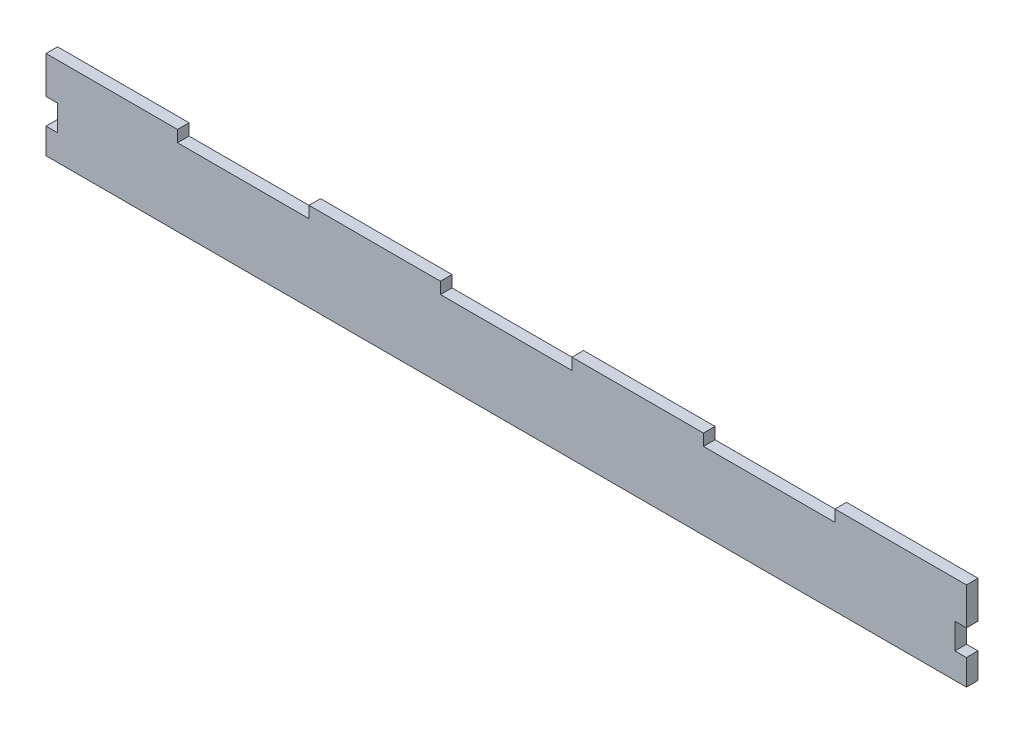
ISO-10303-21;
HEADER;
FILE_DESCRIPTION(('STEP AP214'),'2;1');
FILE_NAME('part.step','',(''),(''),'','','');
FILE_SCHEMA(('AUTOMOTIVE_DESIGN { 1 0 10303 214 1 1 1 1 }'));
ENDSEC;
DATA;
#1=APPLICATION_CONTEXT('core data for automotive mechanical design processes');
#2=APPLICATION_PROTOCOL_DEFINITION('international standard','automotive_design',2000,#1);
#3=PRODUCT_CONTEXT('',#1,'mechanical');
#4=PRODUCT('Part','Part','',(#3));
#5=PRODUCT_RELATED_PRODUCT_CATEGORY('part','',(#4));
#6=PRODUCT_DEFINITION_FORMATION('','',#4);
#7=PRODUCT_DEFINITION_CONTEXT('part definition',#1,'design');
#8=PRODUCT_DEFINITION('design','',#6,#7);
#9=PRODUCT_DEFINITION_SHAPE('','',#8);
#10=(LENGTH_UNIT() NAMED_UNIT(*) SI_UNIT(.MILLI.,.METRE.));
#11=(NAMED_UNIT(*) PLANE_ANGLE_UNIT() SI_UNIT($,.RADIAN.));
#12=(NAMED_UNIT(*) SI_UNIT($,.STERADIAN.) SOLID_ANGLE_UNIT());
#13=UNCERTAINTY_MEASURE_WITH_UNIT(LENGTH_MEASURE(1.E-05),#10,'distance_accuracy_value','');
#14=(GEOMETRIC_REPRESENTATION_CONTEXT(3) GLOBAL_UNCERTAINTY_ASSIGNED_CONTEXT((#13)) GLOBAL_UNIT_ASSIGNED_CONTEXT((#10,
#11,#12)) REPRESENTATION_CONTEXT('',''));
#15=CARTESIAN_POINT('',(0.,0.,0.));
#16=DIRECTION('',(0.,0.,1.));
#17=DIRECTION('',(1.,0.,0.));
#18=AXIS2_PLACEMENT_3D('',#15,#16,#17);
#19=CARTESIAN_POINT('',(0.,-34.,-69.25));
#20=DIRECTION('',(0.,0.,-1.));
#21=DIRECTION('',(-1.,0.,0.));
#22=AXIS2_PLACEMENT_3D('',#19,#20,#21);
#23=PLANE('',#22);
#24=DIRECTION('',(0.,1.,0.));
#25=VECTOR('',#24,1.);
#26=CARTESIAN_POINT('',(239.,-34.,-69.25));
#27=LINE('',#26,#25);
#28=CARTESIAN_POINT('',(239.,-7.33333333333333,-69.25));
#29=VERTEX_POINT('',#28);
#30=CARTESIAN_POINT('',(239.,12.,-69.25));
#31=VERTEX_POINT('',#30);
#32=EDGE_CURVE('E48',#29,#31,#27,.T.);
#33=ORIENTED_EDGE('',*,*,#32,.F.);
#34=DIRECTION('',(1.,0.,0.));
#35=VECTOR('',#34,1.);
#36=CARTESIAN_POINT('',(0.,-7.3333333333334,-69.25));
#37=LINE('',#36,#35);
#38=CARTESIAN_POINT('',(233.,-7.33333333333333,-69.25));
#39=VERTEX_POINT('',#38);
#40=EDGE_CURVE('E211',#39,#29,#37,.T.);
#41=ORIENTED_EDGE('',*,*,#40,.F.);
#42=DIRECTION('',(0.,1.,0.));
#43=VECTOR('',#42,1.);
#44=CARTESIAN_POINT('',(233.,0.,-69.25));
#45=LINE('',#44,#43);
#46=CARTESIAN_POINT('',(233.,-20.6666666666667,-69.25));
#47=VERTEX_POINT('',#46);
#48=EDGE_CURVE('E212',#47,#39,#45,.T.);
#49=ORIENTED_EDGE('',*,*,#48,.F.);
#50=DIRECTION('',(-1.,0.,0.));
#51=VECTOR('',#50,1.);
#52=CARTESIAN_POINT('',(0.,-20.6666666666667,-69.25));
#53=LINE('',#52,#51);
#54=CARTESIAN_POINT('',(239.,-20.6666666666667,-69.25));
#55=VERTEX_POINT('',#54);
#56=EDGE_CURVE('E203',#55,#47,#53,.T.);
#57=ORIENTED_EDGE('',*,*,#56,.F.);
#58=CARTESIAN_POINT('',(239.,-34.,-69.25));
#59=VERTEX_POINT('',#58);
#60=EDGE_CURVE('E11',#59,#55,#27,.T.);
#61=ORIENTED_EDGE('',*,*,#60,.F.);
#62=DIRECTION('',(-1.,0.,0.));
#63=VECTOR('',#62,1.);
#64=CARTESIAN_POINT('',(0.,-34.,-69.25));
#65=LINE('',#64,#63);
#66=CARTESIAN_POINT('',(-239.,-34.,-69.2499999999999));
#67=VERTEX_POINT('',#66);
#68=EDGE_CURVE('E351',#59,#67,#65,.T.);
#69=ORIENTED_EDGE('',*,*,#68,.T.);
#70=DIRECTION('',(0.,1.,0.));
#71=VECTOR('',#70,1.);
#72=CARTESIAN_POINT('',(-239.,-34.,-69.2499999999999));
#73=LINE('',#72,#71);
#74=CARTESIAN_POINT('',(-239.,-20.6666666666667,-69.25));
#75=VERTEX_POINT('',#74);
#76=EDGE_CURVE('E43',#67,#75,#73,.T.);
#77=ORIENTED_EDGE('',*,*,#76,.T.);
#78=DIRECTION('',(1.,0.,0.));
#79=VECTOR('',#78,1.);
#80=CARTESIAN_POINT('',(0.,-20.6666666666667,-69.25));
#81=LINE('',#80,#79);
#82=CARTESIAN_POINT('',(-233.,-20.6666666666667,-69.25));
#83=VERTEX_POINT('',#82);
#84=EDGE_CURVE('E241',#75,#83,#81,.T.);
#85=ORIENTED_EDGE('',*,*,#84,.T.);
#86=DIRECTION('',(0.,1.,0.));
#87=VECTOR('',#86,1.);
#88=CARTESIAN_POINT('',(-233.,0.,-69.25));
#89=LINE('',#88,#87);
#90=CARTESIAN_POINT('',(-233.,-7.33333333333333,-69.25));
#91=VERTEX_POINT('',#90);
#92=EDGE_CURVE('E234',#83,#91,#89,.T.);
#93=ORIENTED_EDGE('',*,*,#92,.T.);
#94=DIRECTION('',(-1.,0.,0.));
#95=VECTOR('',#94,1.);
#96=CARTESIAN_POINT('',(0.,-7.3333333333334,-69.25));
#97=LINE('',#96,#95);
#98=CARTESIAN_POINT('',(-239.,-7.33333333333333,-69.25));
#99=VERTEX_POINT('',#98);
#100=EDGE_CURVE('E237',#91,#99,#97,.T.);
#101=ORIENTED_EDGE('',*,*,#100,.T.);
#102=CARTESIAN_POINT('',(-239.,12.,-69.2499999999999));
#103=VERTEX_POINT('',#102);
#104=EDGE_CURVE('E363',#99,#103,#73,.T.);
#105=ORIENTED_EDGE('',*,*,#104,.T.);
#106=DIRECTION('',(-1.,0.,0.));
#107=VECTOR('',#106,1.);
#108=CARTESIAN_POINT('',(0.,12.,-69.25));
#109=LINE('',#108,#107);
#110=CARTESIAN_POINT('',(-170.714285714286,12.,-69.2499999999999));
#111=VERTEX_POINT('',#110);
#112=EDGE_CURVE('E330',#111,#103,#109,.T.);
#113=ORIENTED_EDGE('',*,*,#112,.F.);
#114=DIRECTION('',(0.,-1.,0.));
#115=VECTOR('',#114,1.);
#116=CARTESIAN_POINT('',(-170.714285714286,12.,-69.2499999999999));
#117=LINE('',#116,#115);
#118=CARTESIAN_POINT('',(-170.714285714286,6.,-69.2499999999999));
#119=VERTEX_POINT('',#118);
#120=EDGE_CURVE('E342',#111,#119,#117,.T.);
#121=ORIENTED_EDGE('',*,*,#120,.T.);
#122=DIRECTION('',(-1.,0.,0.));
#123=VECTOR('',#122,1.);
#124=CARTESIAN_POINT('',(0.,6.,-69.25));
#125=LINE('',#124,#123);
#126=CARTESIAN_POINT('',(-102.428571428571,6.,-69.25));
#127=VERTEX_POINT('',#126);
#128=EDGE_CURVE('E350',#127,#119,#125,.T.);
#129=ORIENTED_EDGE('',*,*,#128,.F.);
#130=DIRECTION('',(0.,-1.,0.));
#131=VECTOR('',#130,1.);
#132=CARTESIAN_POINT('',(-102.428571428571,12.,-69.25));
#133=LINE('',#132,#131);
#134=CARTESIAN_POINT('',(-102.428571428571,12.,-69.25));
#135=VERTEX_POINT('',#134);
#136=EDGE_CURVE('E327',#135,#127,#133,.T.);
#137=ORIENTED_EDGE('',*,*,#136,.F.);
#138=DIRECTION('',(-1.,0.,0.));
#139=VECTOR('',#138,1.);
#140=CARTESIAN_POINT('',(0.,12.,-69.25));
#141=LINE('',#140,#139);
#142=CARTESIAN_POINT('',(-34.1428571428572,12.,-69.25));
#143=VERTEX_POINT('',#142);
#144=EDGE_CURVE('E303',#143,#135,#141,.T.);
#145=ORIENTED_EDGE('',*,*,#144,.F.);
#146=DIRECTION('',(0.,-1.,0.));
#147=VECTOR('',#146,1.);
#148=CARTESIAN_POINT('',(-34.1428571428572,12.,-69.25));
#149=LINE('',#148,#147);
#150=CARTESIAN_POINT('',(-34.1428571428572,6.,-69.25));
#151=VERTEX_POINT('',#150);
#152=EDGE_CURVE('E315',#143,#151,#149,.T.);
#153=ORIENTED_EDGE('',*,*,#152,.T.);
#154=CARTESIAN_POINT('',(34.1428571428571,6.,-69.25));
#155=VERTEX_POINT('',#154);
#156=EDGE_CURVE('E367',#155,#151,#125,.T.);
#157=ORIENTED_EDGE('',*,*,#156,.F.);
#158=DIRECTION('',(0.,-1.,0.));
#159=VECTOR('',#158,1.);
#160=CARTESIAN_POINT('',(34.1428571428571,12.,-69.25));
#161=LINE('',#160,#159);
#162=CARTESIAN_POINT('',(34.1428571428571,12.,-69.25));
#163=VERTEX_POINT('',#162);
#164=EDGE_CURVE('E300',#163,#155,#161,.T.);
#165=ORIENTED_EDGE('',*,*,#164,.F.);
#166=DIRECTION('',(-1.,0.,0.));
#167=VECTOR('',#166,1.);
#168=CARTESIAN_POINT('',(0.,12.,-69.25));
#169=LINE('',#168,#167);
#170=CARTESIAN_POINT('',(102.428571428571,12.,-69.25));
#171=VERTEX_POINT('',#170);
#172=EDGE_CURVE('E276',#171,#163,#169,.T.);
#173=ORIENTED_EDGE('',*,*,#172,.F.);
#174=DIRECTION('',(0.,-1.,0.));
#175=VECTOR('',#174,1.);
#176=CARTESIAN_POINT('',(102.428571428571,12.,-69.25));
#177=LINE('',#176,#175);
#178=CARTESIAN_POINT('',(102.428571428571,6.,-69.25));
#179=VERTEX_POINT('',#178);
#180=EDGE_CURVE('E288',#171,#179,#177,.T.);
#181=ORIENTED_EDGE('',*,*,#180,.T.);
#182=CARTESIAN_POINT('',(170.714285714286,6.,-69.25));
#183=VERTEX_POINT('',#182);
#184=EDGE_CURVE('E364',#183,#179,#125,.T.);
#185=ORIENTED_EDGE('',*,*,#184,.F.);
#186=DIRECTION('',(0.,-1.,0.));
#187=VECTOR('',#186,1.);
#188=CARTESIAN_POINT('',(170.714285714286,12.,-69.25));
#189=LINE('',#188,#187);
#190=CARTESIAN_POINT('',(170.714285714286,12.,-69.25));
#191=VERTEX_POINT('',#190);
#192=EDGE_CURVE('E273',#191,#183,#189,.T.);
#193=ORIENTED_EDGE('',*,*,#192,.F.);
#194=DIRECTION('',(1.,0.,0.));
#195=VECTOR('',#194,1.);
#196=CARTESIAN_POINT('',(0.,12.,-69.25));
#197=LINE('',#196,#195);
#198=EDGE_CURVE('E258',#191,#31,#197,.T.);
#199=ORIENTED_EDGE('',*,*,#198,.T.);
#200=EDGE_LOOP('',(#33,#41,#49,#57,#61,#69,#77,#85,#93,#101,#105,#113,#121,#129,#137,#145,#153,
#157,#165,#173,#181,#185,#193,#199));
#201=FACE_BOUND('',#200,.T.);
#202=ADVANCED_FACE('F39',(#201),#23,.T.);
#203=CARTESIAN_POINT('',(239.,-34.,0.));
#204=DIRECTION('',(1.,0.,0.));
#205=DIRECTION('',(0.,0.,-1.));
#206=AXIS2_PLACEMENT_3D('',#203,#204,#205);
#207=PLANE('',#206);
#208=DIRECTION('',(0.,1.,0.));
#209=VECTOR('',#208,1.);
#210=CARTESIAN_POINT('',(239.,-34.,-63.25));
#211=LINE('',#210,#209);
#212=CARTESIAN_POINT('',(239.,-7.33333333333333,-63.25));
#213=VERTEX_POINT('',#212);
#214=CARTESIAN_POINT('',(239.,12.,-63.25));
#215=VERTEX_POINT('',#214);
#216=EDGE_CURVE('E372',#213,#215,#211,.T.);
#217=ORIENTED_EDGE('',*,*,#216,.F.);
#218=DIRECTION('',(0.,0.,1.));
#219=VECTOR('',#218,1.);
#220=CARTESIAN_POINT('',(239.,-7.33333333333333,-69.25));
#221=LINE('',#220,#219);
#222=EDGE_CURVE('E231',#29,#213,#221,.T.);
#223=ORIENTED_EDGE('',*,*,#222,.F.);
#224=ORIENTED_EDGE('',*,*,#32,.T.);
#225=DIRECTION('',(0.,0.,-1.));
#226=VECTOR('',#225,1.);
#227=CARTESIAN_POINT('',(239.,12.,0.));
#228=LINE('',#227,#226);
#229=EDGE_CURVE('E266',#215,#31,#228,.T.);
#230=ORIENTED_EDGE('',*,*,#229,.F.);
#231=EDGE_LOOP('',(#217,#223,#224,#230));
#232=FACE_BOUND('',#231,.T.);
#233=ADVANCED_FACE('F430',(#232),#207,.T.);
#234=ORIENTED_EDGE('',*,*,#60,.T.);
#235=DIRECTION('',(0.,0.,1.));
#236=VECTOR('',#235,1.);
#237=CARTESIAN_POINT('',(239.,-20.6666666666667,-69.25));
#238=LINE('',#237,#236);
#239=CARTESIAN_POINT('',(239.,-20.6666666666667,-63.25));
#240=VERTEX_POINT('',#239);
#241=EDGE_CURVE('E208',#55,#240,#238,.T.);
#242=ORIENTED_EDGE('',*,*,#241,.T.);
#243=CARTESIAN_POINT('',(239.,-34.,-63.25));
#244=VERTEX_POINT('',#243);
#245=EDGE_CURVE('E370',#244,#240,#211,.T.);
#246=ORIENTED_EDGE('',*,*,#245,.F.);
#247=DIRECTION('',(0.,0.,-1.));
#248=VECTOR('',#247,1.);
#249=CARTESIAN_POINT('',(239.,-34.,0.));
#250=LINE('',#249,#248);
#251=EDGE_CURVE('E360',#244,#59,#250,.T.);
#252=ORIENTED_EDGE('',*,*,#251,.T.);
#253=EDGE_LOOP('',(#234,#242,#246,#252));
#254=FACE_BOUND('',#253,.T.);
#255=ADVANCED_FACE('F434',(#254),#207,.T.);
#256=CARTESIAN_POINT('',(0.,-34.,-63.25));
#257=DIRECTION('',(0.,0.,-1.));
#258=DIRECTION('',(-1.,0.,0.));
#259=AXIS2_PLACEMENT_3D('',#256,#257,#258);
#260=PLANE('',#259);
#261=DIRECTION('',(1.,0.,0.));
#262=VECTOR('',#261,1.);
#263=CARTESIAN_POINT('',(0.,-7.3333333333334,-63.25));
#264=LINE('',#263,#262);
#265=CARTESIAN_POINT('',(233.,-7.33333333333333,-63.25));
#266=VERTEX_POINT('',#265);
#267=EDGE_CURVE('E219',#266,#213,#264,.T.);
#268=ORIENTED_EDGE('',*,*,#267,.T.);
#269=ORIENTED_EDGE('',*,*,#216,.T.);
#270=DIRECTION('',(-1.,0.,0.));
#271=VECTOR('',#270,1.);
#272=CARTESIAN_POINT('',(0.,12.,-63.25));
#273=LINE('',#272,#271);
#274=CARTESIAN_POINT('',(170.714285714286,12.,-63.25));
#275=VERTEX_POINT('',#274);
#276=EDGE_CURVE('E263',#215,#275,#273,.T.);
#277=ORIENTED_EDGE('',*,*,#276,.T.);
#278=DIRECTION('',(0.,-1.,0.));
#279=VECTOR('',#278,1.);
#280=CARTESIAN_POINT('',(170.714285714286,12.,-63.25));
#281=LINE('',#280,#279);
#282=CARTESIAN_POINT('',(170.714285714286,6.,-63.25));
#283=VERTEX_POINT('',#282);
#284=EDGE_CURVE('E269',#275,#283,#281,.T.);
#285=ORIENTED_EDGE('',*,*,#284,.T.);
#286=DIRECTION('',(-1.,0.,0.));
#287=VECTOR('',#286,1.);
#288=CARTESIAN_POINT('',(0.,6.,-63.25));
#289=LINE('',#288,#287);
#290=CARTESIAN_POINT('',(102.428571428571,6.,-63.25));
#291=VERTEX_POINT('',#290);
#292=EDGE_CURVE('E355',#283,#291,#289,.T.);
#293=ORIENTED_EDGE('',*,*,#292,.T.);
#294=DIRECTION('',(0.,-1.,0.));
#295=VECTOR('',#294,1.);
#296=CARTESIAN_POINT('',(102.428571428571,12.,-63.25));
#297=LINE('',#296,#295);
#298=CARTESIAN_POINT('',(102.428571428571,12.,-63.25));
#299=VERTEX_POINT('',#298);
#300=EDGE_CURVE('E294',#299,#291,#297,.T.);
#301=ORIENTED_EDGE('',*,*,#300,.F.);
#302=DIRECTION('',(-1.,0.,0.));
#303=VECTOR('',#302,1.);
#304=CARTESIAN_POINT('',(0.,12.,-63.25));
#305=LINE('',#304,#303);
#306=CARTESIAN_POINT('',(34.1428571428571,12.,-63.25));
#307=VERTEX_POINT('',#306);
#308=EDGE_CURVE('E282',#299,#307,#305,.T.);
#309=ORIENTED_EDGE('',*,*,#308,.T.);
#310=DIRECTION('',(0.,-1.,0.));
#311=VECTOR('',#310,1.);
#312=CARTESIAN_POINT('',(34.1428571428571,12.,-63.25));
#313=LINE('',#312,#311);
#314=CARTESIAN_POINT('',(34.1428571428571,6.,-63.25));
#315=VERTEX_POINT('',#314);
#316=EDGE_CURVE('E297',#307,#315,#313,.T.);
#317=ORIENTED_EDGE('',*,*,#316,.T.);
#318=CARTESIAN_POINT('',(-34.1428571428572,6.,-63.25));
#319=VERTEX_POINT('',#318);
#320=EDGE_CURVE('E368',#315,#319,#289,.T.);
#321=ORIENTED_EDGE('',*,*,#320,.T.);
#322=DIRECTION('',(0.,-1.,0.));
#323=VECTOR('',#322,1.);
#324=CARTESIAN_POINT('',(-34.1428571428572,12.,-63.25));
#325=LINE('',#324,#323);
#326=CARTESIAN_POINT('',(-34.1428571428572,12.,-63.25));
#327=VERTEX_POINT('',#326);
#328=EDGE_CURVE('E321',#327,#319,#325,.T.);
#329=ORIENTED_EDGE('',*,*,#328,.F.);
#330=DIRECTION('',(-1.,0.,0.));
#331=VECTOR('',#330,1.);
#332=CARTESIAN_POINT('',(0.,12.,-63.25));
#333=LINE('',#332,#331);
#334=CARTESIAN_POINT('',(-102.428571428571,12.,-63.25));
#335=VERTEX_POINT('',#334);
#336=EDGE_CURVE('E309',#327,#335,#333,.T.);
#337=ORIENTED_EDGE('',*,*,#336,.T.);
#338=DIRECTION('',(0.,-1.,0.));
#339=VECTOR('',#338,1.);
#340=CARTESIAN_POINT('',(-102.428571428571,12.,-63.25));
#341=LINE('',#340,#339);
#342=CARTESIAN_POINT('',(-102.428571428571,6.,-63.2499999999999));
#343=VERTEX_POINT('',#342);
#344=EDGE_CURVE('E324',#335,#343,#341,.T.);
#345=ORIENTED_EDGE('',*,*,#344,.T.);
#346=CARTESIAN_POINT('',(-170.714285714286,6.,-63.2499999999999));
#347=VERTEX_POINT('',#346);
#348=EDGE_CURVE('E366',#343,#347,#289,.T.);
#349=ORIENTED_EDGE('',*,*,#348,.T.);
#350=DIRECTION('',(0.,-1.,0.));
#351=VECTOR('',#350,1.);
#352=CARTESIAN_POINT('',(-170.714285714286,12.,-63.25));
#353=LINE('',#352,#351);
#354=CARTESIAN_POINT('',(-170.714285714286,12.,-63.25));
#355=VERTEX_POINT('',#354);
#356=EDGE_CURVE('E347',#355,#347,#353,.T.);
#357=ORIENTED_EDGE('',*,*,#356,.F.);
#358=DIRECTION('',(-1.,0.,0.));
#359=VECTOR('',#358,1.);
#360=CARTESIAN_POINT('',(0.,12.,-63.25));
#361=LINE('',#360,#359);
#362=CARTESIAN_POINT('',(-239.,12.,-63.2499999999999));
#363=VERTEX_POINT('',#362);
#364=EDGE_CURVE('E336',#355,#363,#361,.T.);
#365=ORIENTED_EDGE('',*,*,#364,.T.);
#366=DIRECTION('',(0.,1.,0.));
#367=VECTOR('',#366,1.);
#368=CARTESIAN_POINT('',(-239.,-34.,-63.2499999999999));
#369=LINE('',#368,#367);
#370=CARTESIAN_POINT('',(-239.,-7.33333333333333,-63.2499999999999));
#371=VERTEX_POINT('',#370);
#372=EDGE_CURVE('E375',#371,#363,#369,.T.);
#373=ORIENTED_EDGE('',*,*,#372,.F.);
#374=DIRECTION('',(-1.,0.,0.));
#375=VECTOR('',#374,1.);
#376=CARTESIAN_POINT('',(0.,-7.3333333333334,-63.25));
#377=LINE('',#376,#375);
#378=CARTESIAN_POINT('',(-233.,-7.33333333333333,-63.25));
#379=VERTEX_POINT('',#378);
#380=EDGE_CURVE('E64',#379,#371,#377,.T.);
#381=ORIENTED_EDGE('',*,*,#380,.F.);
#382=DIRECTION('',(0.,1.,0.));
#383=VECTOR('',#382,1.);
#384=CARTESIAN_POINT('',(-233.,0.,-63.25));
#385=LINE('',#384,#383);
#386=CARTESIAN_POINT('',(-233.,-20.6666666666667,-63.25));
#387=VERTEX_POINT('',#386);
#388=EDGE_CURVE('E230',#387,#379,#385,.T.);
#389=ORIENTED_EDGE('',*,*,#388,.F.);
#390=DIRECTION('',(1.,0.,0.));
#391=VECTOR('',#390,1.);
#392=CARTESIAN_POINT('',(0.,-20.6666666666667,-63.25));
#393=LINE('',#392,#391);
#394=CARTESIAN_POINT('',(-239.,-20.6666666666667,-63.25));
#395=VERTEX_POINT('',#394);
#396=EDGE_CURVE('E238',#395,#387,#393,.T.);
#397=ORIENTED_EDGE('',*,*,#396,.F.);
#398=CARTESIAN_POINT('',(-239.,-34.,-63.2499999999999));
#399=VERTEX_POINT('',#398);
#400=EDGE_CURVE('E373',#399,#395,#369,.T.);
#401=ORIENTED_EDGE('',*,*,#400,.F.);
#402=DIRECTION('',(-1.,0.,0.));
#403=VECTOR('',#402,1.);
#404=CARTESIAN_POINT('',(0.,-34.,-63.25));
#405=LINE('',#404,#403);
#406=EDGE_CURVE('E358',#244,#399,#405,.T.);
#407=ORIENTED_EDGE('',*,*,#406,.F.);
#408=ORIENTED_EDGE('',*,*,#245,.T.);
#409=DIRECTION('',(-1.,0.,0.));
#410=VECTOR('',#409,1.);
#411=CARTESIAN_POINT('',(0.,-20.6666666666667,-63.25));
#412=LINE('',#411,#410);
#413=CARTESIAN_POINT('',(233.,-20.6666666666667,-63.25));
#414=VERTEX_POINT('',#413);
#415=EDGE_CURVE('E222',#240,#414,#412,.T.);
#416=ORIENTED_EDGE('',*,*,#415,.T.);
#417=DIRECTION('',(0.,1.,0.));
#418=VECTOR('',#417,1.);
#419=CARTESIAN_POINT('',(233.,0.,-63.25));
#420=LINE('',#419,#418);
#421=EDGE_CURVE('E56',#414,#266,#420,.T.);
#422=ORIENTED_EDGE('',*,*,#421,.T.);
#423=EDGE_LOOP('',(#268,#269,#277,#285,#293,#301,#309,#317,#321,#329,#337,#345,#349,#357,#365,
#373,#381,#389,#397,#401,#407,#408,#416,#422));
#424=FACE_BOUND('',#423,.T.);
#425=ADVANCED_FACE('F411',(#424),#260,.F.);
#426=CARTESIAN_POINT('',(-239.,-34.,0.));
#427=DIRECTION('',(-1.,0.,0.));
#428=DIRECTION('',(0.,0.,1.));
#429=AXIS2_PLACEMENT_3D('',#426,#427,#428);
#430=PLANE('',#429);
#431=DIRECTION('',(0.,0.,1.));
#432=VECTOR('',#431,1.);
#433=CARTESIAN_POINT('',(-239.,-20.6666666666667,-69.25));
#434=LINE('',#433,#432);
#435=EDGE_CURVE('E253',#75,#395,#434,.T.);
#436=ORIENTED_EDGE('',*,*,#435,.F.);
#437=ORIENTED_EDGE('',*,*,#76,.F.);
#438=DIRECTION('',(0.,0.,1.));
#439=VECTOR('',#438,1.);
#440=CARTESIAN_POINT('',(-239.,-34.,0.));
#441=LINE('',#440,#439);
#442=EDGE_CURVE('E354',#67,#399,#441,.T.);
#443=ORIENTED_EDGE('',*,*,#442,.T.);
#444=ORIENTED_EDGE('',*,*,#400,.T.);
#445=EDGE_LOOP('',(#436,#437,#443,#444));
#446=FACE_BOUND('',#445,.T.);
#447=ADVANCED_FACE('F426',(#446),#430,.T.);
#448=CARTESIAN_POINT('',(0.,6.,0.));
#449=DIRECTION('',(0.,-1.,0.));
#450=DIRECTION('',(0.,0.,-1.));
#451=AXIS2_PLACEMENT_3D('',#448,#449,#450);
#452=PLANE('',#451);
#453=DIRECTION('',(0.,0.,1.));
#454=VECTOR('',#453,1.);
#455=CARTESIAN_POINT('',(170.714285714286,6.,0.));
#456=LINE('',#455,#454);
#457=EDGE_CURVE('E252',#183,#283,#456,.T.);
#458=ORIENTED_EDGE('',*,*,#457,.F.);
#459=ORIENTED_EDGE('',*,*,#184,.T.);
#460=DIRECTION('',(0.,0.,1.));
#461=VECTOR('',#460,1.);
#462=CARTESIAN_POINT('',(102.428571428571,6.,0.));
#463=LINE('',#462,#461);
#464=EDGE_CURVE('E280',#179,#291,#463,.T.);
#465=ORIENTED_EDGE('',*,*,#464,.T.);
#466=ORIENTED_EDGE('',*,*,#292,.F.);
#467=EDGE_LOOP('',(#458,#459,#465,#466));
#468=FACE_BOUND('',#467,.T.);
#469=ADVANCED_FACE('F41',(#468),#452,.F.);
#470=DIRECTION('',(0.,0.,1.));
#471=VECTOR('',#470,1.);
#472=CARTESIAN_POINT('',(34.1428571428571,6.,0.));
#473=LINE('',#472,#471);
#474=EDGE_CURVE('E275',#155,#315,#473,.T.);
#475=ORIENTED_EDGE('',*,*,#474,.F.);
#476=ORIENTED_EDGE('',*,*,#156,.T.);
#477=DIRECTION('',(0.,0.,1.));
#478=VECTOR('',#477,1.);
#479=CARTESIAN_POINT('',(-34.1428571428572,6.,0.));
#480=LINE('',#479,#478);
#481=EDGE_CURVE('E307',#151,#319,#480,.T.);
#482=ORIENTED_EDGE('',*,*,#481,.T.);
#483=ORIENTED_EDGE('',*,*,#320,.F.);
#484=EDGE_LOOP('',(#475,#476,#482,#483));
#485=FACE_BOUND('',#484,.T.);
#486=ADVANCED_FACE('F402',(#485),#452,.F.);
#487=DIRECTION('',(0.,0.,1.));
#488=VECTOR('',#487,1.);
#489=CARTESIAN_POINT('',(-102.428571428571,6.,0.));
#490=LINE('',#489,#488);
#491=EDGE_CURVE('E302',#127,#343,#490,.T.);
#492=ORIENTED_EDGE('',*,*,#491,.F.);
#493=ORIENTED_EDGE('',*,*,#128,.T.);
#494=DIRECTION('',(0.,0.,1.));
#495=VECTOR('',#494,1.);
#496=CARTESIAN_POINT('',(-170.714285714286,6.,0.));
#497=LINE('',#496,#495);
#498=EDGE_CURVE('E329',#119,#347,#497,.T.);
#499=ORIENTED_EDGE('',*,*,#498,.T.);
#500=ORIENTED_EDGE('',*,*,#348,.F.);
#501=EDGE_LOOP('',(#492,#493,#499,#500));
#502=FACE_BOUND('',#501,.T.);
#503=ADVANCED_FACE('F418',(#502),#452,.F.);
#504=DIRECTION('',(0.,0.,1.));
#505=VECTOR('',#504,1.);
#506=CARTESIAN_POINT('',(-239.,-7.33333333333333,-69.25));
#507=LINE('',#506,#505);
#508=EDGE_CURVE('E255',#99,#371,#507,.T.);
#509=ORIENTED_EDGE('',*,*,#508,.T.);
#510=ORIENTED_EDGE('',*,*,#372,.T.);
#511=DIRECTION('',(0.,0.,1.));
#512=VECTOR('',#511,1.);
#513=CARTESIAN_POINT('',(-239.,12.,0.));
#514=LINE('',#513,#512);
#515=EDGE_CURVE('E333',#103,#363,#514,.T.);
#516=ORIENTED_EDGE('',*,*,#515,.F.);
#517=ORIENTED_EDGE('',*,*,#104,.F.);
#518=EDGE_LOOP('',(#509,#510,#516,#517));
#519=FACE_BOUND('',#518,.T.);
#520=ADVANCED_FACE('F387',(#519),#430,.T.);
#521=CARTESIAN_POINT('',(0.,-34.,0.));
#522=DIRECTION('',(0.,1.,0.));
#523=DIRECTION('',(0.,0.,1.));
#524=AXIS2_PLACEMENT_3D('',#521,#522,#523);
#525=PLANE('',#524);
#526=ORIENTED_EDGE('',*,*,#68,.F.);
#527=ORIENTED_EDGE('',*,*,#251,.F.);
#528=ORIENTED_EDGE('',*,*,#406,.T.);
#529=ORIENTED_EDGE('',*,*,#442,.F.);
#530=EDGE_LOOP('',(#526,#527,#528,#529));
#531=FACE_BOUND('',#530,.T.);
#532=ADVANCED_FACE('F424',(#531),#525,.F.);
#533=CARTESIAN_POINT('',(-170.714285714286,12.,0.));
#534=DIRECTION('',(1.,0.,0.));
#535=DIRECTION('',(0.,0.,-1.));
#536=AXIS2_PLACEMENT_3D('',#533,#534,#535);
#537=PLANE('',#536);
#538=ORIENTED_EDGE('',*,*,#498,.F.);
#539=ORIENTED_EDGE('',*,*,#120,.F.);
#540=DIRECTION('',(0.,0.,1.));
#541=VECTOR('',#540,1.);
#542=CARTESIAN_POINT('',(-170.714285714286,12.,0.));
#543=LINE('',#542,#541);
#544=EDGE_CURVE('E339',#111,#355,#543,.T.);
#545=ORIENTED_EDGE('',*,*,#544,.T.);
#546=ORIENTED_EDGE('',*,*,#356,.T.);
#547=EDGE_LOOP('',(#538,#539,#545,#546));
#548=FACE_BOUND('',#547,.T.);
#549=ADVANCED_FACE('F393',(#548),#537,.T.);
#550=CARTESIAN_POINT('',(0.,12.,0.));
#551=DIRECTION('',(0.,1.,0.));
#552=DIRECTION('',(0.,0.,1.));
#553=AXIS2_PLACEMENT_3D('',#550,#551,#552);
#554=PLANE('',#553);
#555=ORIENTED_EDGE('',*,*,#112,.T.);
#556=ORIENTED_EDGE('',*,*,#515,.T.);
#557=ORIENTED_EDGE('',*,*,#364,.F.);
#558=ORIENTED_EDGE('',*,*,#544,.F.);
#559=EDGE_LOOP('',(#555,#556,#557,#558));
#560=FACE_BOUND('',#559,.T.);
#561=ADVANCED_FACE('F390',(#560),#554,.T.);
#562=CARTESIAN_POINT('',(-102.428571428571,12.,0.));
#563=DIRECTION('',(1.,0.,0.));
#564=DIRECTION('',(0.,0.,-1.));
#565=AXIS2_PLACEMENT_3D('',#562,#563,#564);
#566=PLANE('',#565);
#567=ORIENTED_EDGE('',*,*,#491,.T.);
#568=ORIENTED_EDGE('',*,*,#344,.F.);
#569=DIRECTION('',(0.,0.,1.));
#570=VECTOR('',#569,1.);
#571=CARTESIAN_POINT('',(-102.428571428571,12.,0.));
#572=LINE('',#571,#570);
#573=EDGE_CURVE('E306',#135,#335,#572,.T.);
#574=ORIENTED_EDGE('',*,*,#573,.F.);
#575=ORIENTED_EDGE('',*,*,#136,.T.);
#576=EDGE_LOOP('',(#567,#568,#574,#575));
#577=FACE_BOUND('',#576,.T.);
#578=ADVANCED_FACE('F416',(#577),#566,.F.);
#579=CARTESIAN_POINT('',(-34.1428571428572,12.,0.));
#580=DIRECTION('',(1.,0.,0.));
#581=DIRECTION('',(0.,0.,-1.));
#582=AXIS2_PLACEMENT_3D('',#579,#580,#581);
#583=PLANE('',#582);
#584=ORIENTED_EDGE('',*,*,#481,.F.);
#585=ORIENTED_EDGE('',*,*,#152,.F.);
#586=DIRECTION('',(0.,0.,1.));
#587=VECTOR('',#586,1.);
#588=CARTESIAN_POINT('',(-34.1428571428572,12.,0.));
#589=LINE('',#588,#587);
#590=EDGE_CURVE('E312',#143,#327,#589,.T.);
#591=ORIENTED_EDGE('',*,*,#590,.T.);
#592=ORIENTED_EDGE('',*,*,#328,.T.);
#593=EDGE_LOOP('',(#584,#585,#591,#592));
#594=FACE_BOUND('',#593,.T.);
#595=ADVANCED_FACE('F408',(#594),#583,.T.);
#596=CARTESIAN_POINT('',(0.,12.,0.));
#597=DIRECTION('',(0.,1.,0.));
#598=DIRECTION('',(0.,0.,1.));
#599=AXIS2_PLACEMENT_3D('',#596,#597,#598);
#600=PLANE('',#599);
#601=ORIENTED_EDGE('',*,*,#144,.T.);
#602=ORIENTED_EDGE('',*,*,#573,.T.);
#603=ORIENTED_EDGE('',*,*,#336,.F.);
#604=ORIENTED_EDGE('',*,*,#590,.F.);
#605=EDGE_LOOP('',(#601,#602,#603,#604));
#606=FACE_BOUND('',#605,.T.);
#607=ADVANCED_FACE('F413',(#606),#600,.T.);
#608=CARTESIAN_POINT('',(34.1428571428571,12.,0.));
#609=DIRECTION('',(1.,0.,0.));
#610=DIRECTION('',(0.,0.,-1.));
#611=AXIS2_PLACEMENT_3D('',#608,#609,#610);
#612=PLANE('',#611);
#613=ORIENTED_EDGE('',*,*,#474,.T.);
#614=ORIENTED_EDGE('',*,*,#316,.F.);
#615=DIRECTION('',(0.,0.,1.));
#616=VECTOR('',#615,1.);
#617=CARTESIAN_POINT('',(34.1428571428571,12.,0.));
#618=LINE('',#617,#616);
#619=EDGE_CURVE('E279',#163,#307,#618,.T.);
#620=ORIENTED_EDGE('',*,*,#619,.F.);
#621=ORIENTED_EDGE('',*,*,#164,.T.);
#622=EDGE_LOOP('',(#613,#614,#620,#621));
#623=FACE_BOUND('',#622,.T.);
#624=ADVANCED_FACE('F453',(#623),#612,.F.);
#625=CARTESIAN_POINT('',(102.428571428571,12.,0.));
#626=DIRECTION('',(1.,0.,0.));
#627=DIRECTION('',(0.,0.,-1.));
#628=AXIS2_PLACEMENT_3D('',#625,#626,#627);
#629=PLANE('',#628);
#630=ORIENTED_EDGE('',*,*,#464,.F.);
#631=ORIENTED_EDGE('',*,*,#180,.F.);
#632=DIRECTION('',(0.,0.,1.));
#633=VECTOR('',#632,1.);
#634=CARTESIAN_POINT('',(102.428571428571,12.,0.));
#635=LINE('',#634,#633);
#636=EDGE_CURVE('E285',#171,#299,#635,.T.);
#637=ORIENTED_EDGE('',*,*,#636,.T.);
#638=ORIENTED_EDGE('',*,*,#300,.T.);
#639=EDGE_LOOP('',(#630,#631,#637,#638));
#640=FACE_BOUND('',#639,.T.);
#641=ADVANCED_FACE('F456',(#640),#629,.T.);
#642=CARTESIAN_POINT('',(0.,12.,0.));
#643=DIRECTION('',(0.,1.,0.));
#644=DIRECTION('',(0.,0.,1.));
#645=AXIS2_PLACEMENT_3D('',#642,#643,#644);
#646=PLANE('',#645);
#647=ORIENTED_EDGE('',*,*,#172,.T.);
#648=ORIENTED_EDGE('',*,*,#619,.T.);
#649=ORIENTED_EDGE('',*,*,#308,.F.);
#650=ORIENTED_EDGE('',*,*,#636,.F.);
#651=EDGE_LOOP('',(#647,#648,#649,#650));
#652=FACE_BOUND('',#651,.T.);
#653=ADVANCED_FACE('F460',(#652),#646,.T.);
#654=CARTESIAN_POINT('',(170.714285714286,12.,0.));
#655=DIRECTION('',(1.,0.,0.));
#656=DIRECTION('',(0.,0.,-1.));
#657=AXIS2_PLACEMENT_3D('',#654,#655,#656);
#658=PLANE('',#657);
#659=ORIENTED_EDGE('',*,*,#457,.T.);
#660=ORIENTED_EDGE('',*,*,#284,.F.);
#661=DIRECTION('',(0.,0.,1.));
#662=VECTOR('',#661,1.);
#663=CARTESIAN_POINT('',(170.714285714286,12.,0.));
#664=LINE('',#663,#662);
#665=EDGE_CURVE('E261',#191,#275,#664,.T.);
#666=ORIENTED_EDGE('',*,*,#665,.F.);
#667=ORIENTED_EDGE('',*,*,#192,.T.);
#668=EDGE_LOOP('',(#659,#660,#666,#667));
#669=FACE_BOUND('',#668,.T.);
#670=ADVANCED_FACE('F464',(#669),#658,.F.);
#671=CARTESIAN_POINT('',(0.,12.,0.));
#672=DIRECTION('',(0.,1.,0.));
#673=DIRECTION('',(0.,0.,1.));
#674=AXIS2_PLACEMENT_3D('',#671,#672,#673);
#675=PLANE('',#674);
#676=ORIENTED_EDGE('',*,*,#198,.F.);
#677=ORIENTED_EDGE('',*,*,#665,.T.);
#678=ORIENTED_EDGE('',*,*,#276,.F.);
#679=ORIENTED_EDGE('',*,*,#229,.T.);
#680=EDGE_LOOP('',(#676,#677,#678,#679));
#681=FACE_BOUND('',#680,.T.);
#682=ADVANCED_FACE('F468',(#681),#675,.T.);
#683=CARTESIAN_POINT('',(-233.,0.,-69.25));
#684=DIRECTION('',(1.,0.,0.));
#685=DIRECTION('',(0.,0.,-1.));
#686=AXIS2_PLACEMENT_3D('',#683,#684,#685);
#687=PLANE('',#686);
#688=ORIENTED_EDGE('',*,*,#388,.T.);
#689=DIRECTION('',(0.,0.,1.));
#690=VECTOR('',#689,1.);
#691=CARTESIAN_POINT('',(-233.,-7.33333333333333,-69.25));
#692=LINE('',#691,#690);
#693=EDGE_CURVE('E244',#91,#379,#692,.T.);
#694=ORIENTED_EDGE('',*,*,#693,.F.);
#695=ORIENTED_EDGE('',*,*,#92,.F.);
#696=DIRECTION('',(0.,0.,1.));
#697=VECTOR('',#696,1.);
#698=CARTESIAN_POINT('',(-233.,-20.6666666666667,-69.25));
#699=LINE('',#698,#697);
#700=EDGE_CURVE('E250',#83,#387,#699,.T.);
#701=ORIENTED_EDGE('',*,*,#700,.T.);
#702=EDGE_LOOP('',(#688,#694,#695,#701));
#703=FACE_BOUND('',#702,.T.);
#704=ADVANCED_FACE('F472',(#703),#687,.F.);
#705=CARTESIAN_POINT('',(0.,-20.6666666666667,-69.25));
#706=DIRECTION('',(0.,-1.,0.));
#707=DIRECTION('',(0.,0.,-1.));
#708=AXIS2_PLACEMENT_3D('',#705,#706,#707);
#709=PLANE('',#708);
#710=ORIENTED_EDGE('',*,*,#396,.T.);
#711=ORIENTED_EDGE('',*,*,#700,.F.);
#712=ORIENTED_EDGE('',*,*,#84,.F.);
#713=ORIENTED_EDGE('',*,*,#435,.T.);
#714=EDGE_LOOP('',(#710,#711,#712,#713));
#715=FACE_BOUND('',#714,.T.);
#716=ADVANCED_FACE('F476',(#715),#709,.F.);
#717=CARTESIAN_POINT('',(0.,-7.3333333333334,-69.25));
#718=DIRECTION('',(0.,1.,0.));
#719=DIRECTION('',(-1.,0.,0.));
#720=AXIS2_PLACEMENT_3D('',#717,#718,#719);
#721=PLANE('',#720);
#722=ORIENTED_EDGE('',*,*,#380,.T.);
#723=ORIENTED_EDGE('',*,*,#508,.F.);
#724=ORIENTED_EDGE('',*,*,#100,.F.);
#725=ORIENTED_EDGE('',*,*,#693,.T.);
#726=EDGE_LOOP('',(#722,#723,#724,#725));
#727=FACE_BOUND('',#726,.T.);
#728=ADVANCED_FACE('F478',(#727),#721,.F.);
#729=CARTESIAN_POINT('',(233.,0.,-69.25));
#730=DIRECTION('',(1.,0.,0.));
#731=DIRECTION('',(0.,0.,-1.));
#732=AXIS2_PLACEMENT_3D('',#729,#730,#731);
#733=PLANE('',#732);
#734=ORIENTED_EDGE('',*,*,#421,.F.);
#735=DIRECTION('',(0.,0.,1.));
#736=VECTOR('',#735,1.);
#737=CARTESIAN_POINT('',(233.,-20.6666666666667,-69.25));
#738=LINE('',#737,#736);
#739=EDGE_CURVE('E205',#47,#414,#738,.T.);
#740=ORIENTED_EDGE('',*,*,#739,.F.);
#741=ORIENTED_EDGE('',*,*,#48,.T.);
#742=DIRECTION('',(0.,0.,1.));
#743=VECTOR('',#742,1.);
#744=CARTESIAN_POINT('',(233.,-7.33333333333333,-69.25));
#745=LINE('',#744,#743);
#746=EDGE_CURVE('E228',#39,#266,#745,.T.);
#747=ORIENTED_EDGE('',*,*,#746,.T.);
#748=EDGE_LOOP('',(#734,#740,#741,#747));
#749=FACE_BOUND('',#748,.T.);
#750=ADVANCED_FACE('F214',(#749),#733,.T.);
#751=CARTESIAN_POINT('',(0.,-7.3333333333334,-69.25));
#752=DIRECTION('',(0.,-1.,0.));
#753=DIRECTION('',(1.,0.,0.));
#754=AXIS2_PLACEMENT_3D('',#751,#752,#753);
#755=PLANE('',#754);
#756=ORIENTED_EDGE('',*,*,#267,.F.);
#757=ORIENTED_EDGE('',*,*,#746,.F.);
#758=ORIENTED_EDGE('',*,*,#40,.T.);
#759=ORIENTED_EDGE('',*,*,#222,.T.);
#760=EDGE_LOOP('',(#756,#757,#758,#759));
#761=FACE_BOUND('',#760,.T.);
#762=ADVANCED_FACE('F486',(#761),#755,.T.);
#763=CARTESIAN_POINT('',(0.,-20.6666666666667,-69.25));
#764=DIRECTION('',(0.,1.,0.));
#765=DIRECTION('',(0.,0.,1.));
#766=AXIS2_PLACEMENT_3D('',#763,#764,#765);
#767=PLANE('',#766);
#768=ORIENTED_EDGE('',*,*,#415,.F.);
#769=ORIENTED_EDGE('',*,*,#241,.F.);
#770=ORIENTED_EDGE('',*,*,#56,.T.);
#771=ORIENTED_EDGE('',*,*,#739,.T.);
#772=EDGE_LOOP('',(#768,#769,#770,#771));
#773=FACE_BOUND('',#772,.T.);
#774=ADVANCED_FACE('F204',(#773),#767,.T.);
#775=CLOSED_SHELL('',(#202,#233,#255,#425,#447,#469,#486,#503,#520,#532,#549,#561,#578,#595,
#607,#624,#641,#653,#670,#682,#704,#716,#728,#750,#762,#774));
#776=MANIFOLD_SOLID_BREP('B2',#775);
#777=ADVANCED_BREP_SHAPE_REPRESENTATION('',(#18,#776),#14);
#778=SHAPE_DEFINITION_REPRESENTATION(#9,#777);
ENDSEC;
END-ISO-10303-21;
